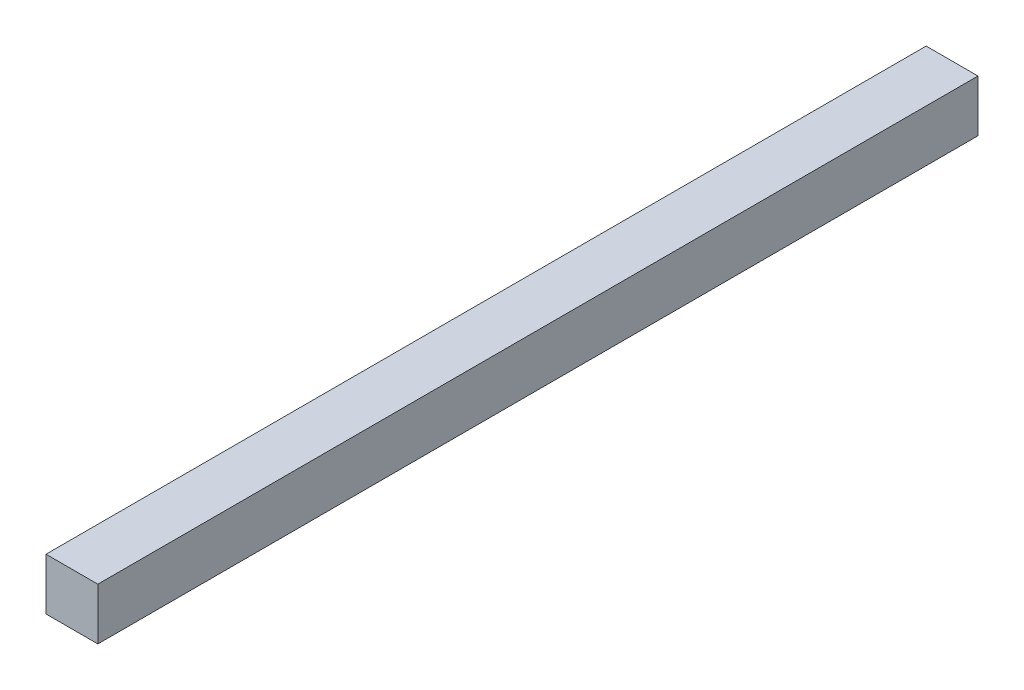
ISO-10303-21;
HEADER;
FILE_DESCRIPTION(('STEP AP214'),'2;1');
FILE_NAME('part.step','',(''),(''),'','','');
FILE_SCHEMA(('AUTOMOTIVE_DESIGN { 1 0 10303 214 1 1 1 1 }'));
ENDSEC;
DATA;
#1=APPLICATION_CONTEXT('core data for automotive mechanical design processes');
#2=APPLICATION_PROTOCOL_DEFINITION('international standard','automotive_design',2000,#1);
#3=PRODUCT_CONTEXT('',#1,'mechanical');
#4=PRODUCT('Part','Part','',(#3));
#5=PRODUCT_RELATED_PRODUCT_CATEGORY('part','',(#4));
#6=PRODUCT_DEFINITION_FORMATION('','',#4);
#7=PRODUCT_DEFINITION_CONTEXT('part definition',#1,'design');
#8=PRODUCT_DEFINITION('design','',#6,#7);
#9=PRODUCT_DEFINITION_SHAPE('','',#8);
#10=(LENGTH_UNIT() NAMED_UNIT(*) SI_UNIT(.MILLI.,.METRE.));
#11=(NAMED_UNIT(*) PLANE_ANGLE_UNIT() SI_UNIT($,.RADIAN.));
#12=(NAMED_UNIT(*) SI_UNIT($,.STERADIAN.) SOLID_ANGLE_UNIT());
#13=UNCERTAINTY_MEASURE_WITH_UNIT(LENGTH_MEASURE(1.E-05),#10,'distance_accuracy_value','');
#14=(GEOMETRIC_REPRESENTATION_CONTEXT(3) GLOBAL_UNCERTAINTY_ASSIGNED_CONTEXT((#13)) GLOBAL_UNIT_ASSIGNED_CONTEXT((#10,
#11,#12)) REPRESENTATION_CONTEXT('',''));
#15=CARTESIAN_POINT('',(0.,0.,0.));
#16=DIRECTION('',(0.,0.,1.));
#17=DIRECTION('',(1.,0.,0.));
#18=AXIS2_PLACEMENT_3D('',#15,#16,#17);
#19=CARTESIAN_POINT('',(-110.658276121753,30.,255.));
#20=DIRECTION('',(1.,0.,0.));
#21=DIRECTION('',(0.,0.,-1.));
#22=AXIS2_PLACEMENT_3D('',#19,#20,#21);
#23=PLANE('',#22);
#24=DIRECTION('',(0.,-1.,0.));
#25=VECTOR('',#24,1.);
#26=CARTESIAN_POINT('',(-110.658276121753,30.,-255.));
#27=LINE('',#26,#25);
#28=CARTESIAN_POINT('',(-110.658276121753,30.,-255.));
#29=VERTEX_POINT('',#28);
#30=CARTESIAN_POINT('',(-110.658276121753,0.,-255.));
#31=VERTEX_POINT('',#30);
#32=EDGE_CURVE('E107',#29,#31,#27,.T.);
#33=ORIENTED_EDGE('',*,*,#32,.T.);
#34=DIRECTION('',(0.,0.,-1.));
#35=VECTOR('',#34,1.);
#36=CARTESIAN_POINT('',(-110.658276121753,0.,255.));
#37=LINE('',#36,#35);
#38=CARTESIAN_POINT('',(-110.658276121753,0.,255.));
#39=VERTEX_POINT('',#38);
#40=EDGE_CURVE('E11',#39,#31,#37,.T.);
#41=ORIENTED_EDGE('',*,*,#40,.F.);
#42=DIRECTION('',(0.,-1.,0.));
#43=VECTOR('',#42,1.);
#44=CARTESIAN_POINT('',(-110.658276121753,30.,255.));
#45=LINE('',#44,#43);
#46=CARTESIAN_POINT('',(-110.658276121753,30.,255.));
#47=VERTEX_POINT('',#46);
#48=EDGE_CURVE('E91',#47,#39,#45,.T.);
#49=ORIENTED_EDGE('',*,*,#48,.F.);
#50=DIRECTION('',(0.,0.,-1.));
#51=VECTOR('',#50,1.);
#52=CARTESIAN_POINT('',(-110.658276121753,30.,255.));
#53=LINE('',#52,#51);
#54=EDGE_CURVE('E103',#47,#29,#53,.T.);
#55=ORIENTED_EDGE('',*,*,#54,.T.);
#56=EDGE_LOOP('',(#33,#41,#49,#55));
#57=FACE_BOUND('',#56,.T.);
#58=ADVANCED_FACE('F39',(#57),#23,.F.);
#59=CARTESIAN_POINT('',(-110.658276121753,0.,255.));
#60=DIRECTION('',(0.,1.,0.));
#61=DIRECTION('',(0.,0.,1.));
#62=AXIS2_PLACEMENT_3D('',#59,#60,#61);
#63=PLANE('',#62);
#64=DIRECTION('',(1.,0.,0.));
#65=VECTOR('',#64,1.);
#66=CARTESIAN_POINT('',(-110.658276121753,0.,-255.));
#67=LINE('',#66,#65);
#68=CARTESIAN_POINT('',(-80.6128609512064,0.,-255.));
#69=VERTEX_POINT('',#68);
#70=EDGE_CURVE('E96',#31,#69,#67,.T.);
#71=ORIENTED_EDGE('',*,*,#70,.T.);
#72=DIRECTION('',(0.,0.,-1.));
#73=VECTOR('',#72,1.);
#74=CARTESIAN_POINT('',(-80.6128609512064,0.,255.));
#75=LINE('',#74,#73);
#76=CARTESIAN_POINT('',(-80.6128609512064,0.,255.));
#77=VERTEX_POINT('',#76);
#78=EDGE_CURVE('E48',#77,#69,#75,.T.);
#79=ORIENTED_EDGE('',*,*,#78,.F.);
#80=DIRECTION('',(1.,0.,0.));
#81=VECTOR('',#80,1.);
#82=CARTESIAN_POINT('',(-110.658276121753,0.,255.));
#83=LINE('',#82,#81);
#84=EDGE_CURVE('E86',#39,#77,#83,.T.);
#85=ORIENTED_EDGE('',*,*,#84,.F.);
#86=ORIENTED_EDGE('',*,*,#40,.T.);
#87=EDGE_LOOP('',(#71,#79,#85,#86));
#88=FACE_BOUND('',#87,.T.);
#89=ADVANCED_FACE('F95',(#88),#63,.F.);
#90=CARTESIAN_POINT('',(-80.6128609512064,30.,255.));
#91=DIRECTION('',(-1.,0.,0.));
#92=DIRECTION('',(0.,0.,1.));
#93=AXIS2_PLACEMENT_3D('',#90,#91,#92);
#94=PLANE('',#93);
#95=DIRECTION('',(0.,1.,0.));
#96=VECTOR('',#95,1.);
#97=CARTESIAN_POINT('',(-80.6128609512064,30.,-255.));
#98=LINE('',#97,#96);
#99=CARTESIAN_POINT('',(-80.6128609512064,30.,-255.));
#100=VERTEX_POINT('',#99);
#101=EDGE_CURVE('E73',#69,#100,#98,.T.);
#102=ORIENTED_EDGE('',*,*,#101,.T.);
#103=DIRECTION('',(0.,0.,-1.));
#104=VECTOR('',#103,1.);
#105=CARTESIAN_POINT('',(-80.6128609512064,30.,255.));
#106=LINE('',#105,#104);
#107=CARTESIAN_POINT('',(-80.6128609512064,30.,255.));
#108=VERTEX_POINT('',#107);
#109=EDGE_CURVE('E98',#108,#100,#106,.T.);
#110=ORIENTED_EDGE('',*,*,#109,.F.);
#111=DIRECTION('',(0.,1.,0.));
#112=VECTOR('',#111,1.);
#113=CARTESIAN_POINT('',(-80.6128609512064,30.,255.));
#114=LINE('',#113,#112);
#115=EDGE_CURVE('E89',#77,#108,#114,.T.);
#116=ORIENTED_EDGE('',*,*,#115,.F.);
#117=ORIENTED_EDGE('',*,*,#78,.T.);
#118=EDGE_LOOP('',(#102,#110,#116,#117));
#119=FACE_BOUND('',#118,.T.);
#120=ADVANCED_FACE('F99',(#119),#94,.F.);
#121=CARTESIAN_POINT('',(-110.658276121753,30.,255.));
#122=DIRECTION('',(0.,-1.,0.));
#123=DIRECTION('',(0.,0.,-1.));
#124=AXIS2_PLACEMENT_3D('',#121,#122,#123);
#125=PLANE('',#124);
#126=DIRECTION('',(-1.,0.,0.));
#127=VECTOR('',#126,1.);
#128=CARTESIAN_POINT('',(-110.658276121753,30.,-255.));
#129=LINE('',#128,#127);
#130=EDGE_CURVE('E79',#100,#29,#129,.T.);
#131=ORIENTED_EDGE('',*,*,#130,.T.);
#132=ORIENTED_EDGE('',*,*,#54,.F.);
#133=DIRECTION('',(-1.,0.,0.));
#134=VECTOR('',#133,1.);
#135=CARTESIAN_POINT('',(-110.658276121753,30.,255.));
#136=LINE('',#135,#134);
#137=EDGE_CURVE('E56',#108,#47,#136,.T.);
#138=ORIENTED_EDGE('',*,*,#137,.F.);
#139=ORIENTED_EDGE('',*,*,#109,.T.);
#140=EDGE_LOOP('',(#131,#132,#138,#139));
#141=FACE_BOUND('',#140,.T.);
#142=ADVANCED_FACE('F120',(#141),#125,.F.);
#143=CARTESIAN_POINT('',(0.,0.,255.));
#144=DIRECTION('',(0.,0.,1.));
#145=DIRECTION('',(1.,0.,0.));
#146=AXIS2_PLACEMENT_3D('',#143,#144,#145);
#147=PLANE('',#146);
#148=ORIENTED_EDGE('',*,*,#48,.T.);
#149=ORIENTED_EDGE('',*,*,#84,.T.);
#150=ORIENTED_EDGE('',*,*,#115,.T.);
#151=ORIENTED_EDGE('',*,*,#137,.T.);
#152=EDGE_LOOP('',(#148,#149,#150,#151));
#153=FACE_BOUND('',#152,.T.);
#154=ADVANCED_FACE('F87',(#153),#147,.T.);
#155=CARTESIAN_POINT('',(0.,0.,-255.));
#156=DIRECTION('',(0.,0.,1.));
#157=DIRECTION('',(1.,0.,0.));
#158=AXIS2_PLACEMENT_3D('',#155,#156,#157);
#159=PLANE('',#158);
#160=ORIENTED_EDGE('',*,*,#32,.F.);
#161=ORIENTED_EDGE('',*,*,#130,.F.);
#162=ORIENTED_EDGE('',*,*,#101,.F.);
#163=ORIENTED_EDGE('',*,*,#70,.F.);
#164=EDGE_LOOP('',(#160,#161,#162,#163));
#165=FACE_BOUND('',#164,.T.);
#166=ADVANCED_FACE('F123',(#165),#159,.F.);
#167=CLOSED_SHELL('',(#58,#89,#120,#142,#154,#166));
#168=MANIFOLD_SOLID_BREP('B2',#167);
#169=ADVANCED_BREP_SHAPE_REPRESENTATION('',(#18,#168),#14);
#170=SHAPE_DEFINITION_REPRESENTATION(#9,#169);
ENDSEC;
END-ISO-10303-21;
